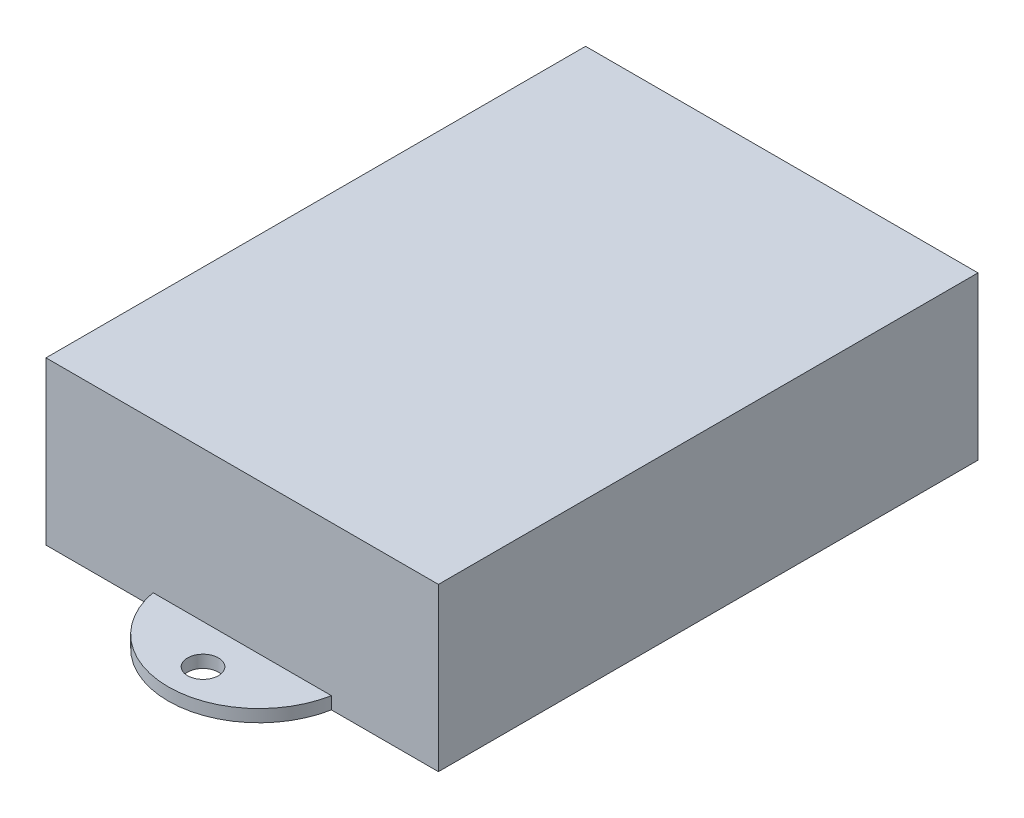
ISO-10303-21;
HEADER;
FILE_DESCRIPTION(('STEP AP214'),'2;1');
FILE_NAME('part.step','',(''),(''),'','','');
FILE_SCHEMA(('AUTOMOTIVE_DESIGN { 1 0 10303 214 1 1 1 1 }'));
ENDSEC;
DATA;
#1=APPLICATION_CONTEXT('core data for automotive mechanical design processes');
#2=APPLICATION_PROTOCOL_DEFINITION('international standard','automotive_design',2000,#1);
#3=PRODUCT_CONTEXT('',#1,'mechanical');
#4=PRODUCT('Part','Part','',(#3));
#5=PRODUCT_RELATED_PRODUCT_CATEGORY('part','',(#4));
#6=PRODUCT_DEFINITION_FORMATION('','',#4);
#7=PRODUCT_DEFINITION_CONTEXT('part definition',#1,'design');
#8=PRODUCT_DEFINITION('design','',#6,#7);
#9=PRODUCT_DEFINITION_SHAPE('','',#8);
#10=(LENGTH_UNIT() NAMED_UNIT(*) SI_UNIT(.MILLI.,.METRE.));
#11=(NAMED_UNIT(*) PLANE_ANGLE_UNIT() SI_UNIT($,.RADIAN.));
#12=(NAMED_UNIT(*) SI_UNIT($,.STERADIAN.) SOLID_ANGLE_UNIT());
#13=UNCERTAINTY_MEASURE_WITH_UNIT(LENGTH_MEASURE(1.E-05),#10,'distance_accuracy_value','');
#14=(GEOMETRIC_REPRESENTATION_CONTEXT(3) GLOBAL_UNCERTAINTY_ASSIGNED_CONTEXT((#13)) GLOBAL_UNIT_ASSIGNED_CONTEXT((#10,
#11,#12)) REPRESENTATION_CONTEXT('',''));
#15=CARTESIAN_POINT('',(0.,0.,0.));
#16=DIRECTION('',(0.,0.,1.));
#17=DIRECTION('',(1.,0.,0.));
#18=AXIS2_PLACEMENT_3D('',#15,#16,#17);
#19=CARTESIAN_POINT('',(0.,21.,0.));
#20=DIRECTION('',(1.,0.,0.));
#21=DIRECTION('',(0.,0.,-1.));
#22=AXIS2_PLACEMENT_3D('',#19,#20,#21);
#23=PLANE('',#22);
#24=DIRECTION('',(0.,0.,1.));
#25=VECTOR('',#24,1.);
#26=CARTESIAN_POINT('',(0.,0.,0.));
#27=LINE('',#26,#25);
#28=CARTESIAN_POINT('',(0.,0.,-69.85));
#29=VERTEX_POINT('',#28);
#30=CARTESIAN_POINT('',(0.,0.,0.));
#31=VERTEX_POINT('',#30);
#32=EDGE_CURVE('E104',#29,#31,#27,.T.);
#33=ORIENTED_EDGE('',*,*,#32,.T.);
#34=DIRECTION('',(0.,-1.,0.));
#35=VECTOR('',#34,1.);
#36=CARTESIAN_POINT('',(0.,21.,0.));
#37=LINE('',#36,#35);
#38=CARTESIAN_POINT('',(0.,21.,0.));
#39=VERTEX_POINT('',#38);
#40=EDGE_CURVE('E41',#39,#31,#37,.T.);
#41=ORIENTED_EDGE('',*,*,#40,.F.);
#42=DIRECTION('',(0.,0.,1.));
#43=VECTOR('',#42,1.);
#44=CARTESIAN_POINT('',(0.,21.,0.));
#45=LINE('',#44,#43);
#46=CARTESIAN_POINT('',(0.,21.,-69.85));
#47=VERTEX_POINT('',#46);
#48=EDGE_CURVE('E137',#47,#39,#45,.T.);
#49=ORIENTED_EDGE('',*,*,#48,.F.);
#50=DIRECTION('',(0.,-1.,0.));
#51=VECTOR('',#50,1.);
#52=CARTESIAN_POINT('',(0.,21.,-69.85));
#53=LINE('',#52,#51);
#54=EDGE_CURVE('E146',#47,#29,#53,.T.);
#55=ORIENTED_EDGE('',*,*,#54,.T.);
#56=EDGE_LOOP('',(#33,#41,#49,#55));
#57=FACE_BOUND('',#56,.T.);
#58=ADVANCED_FACE('F34',(#57),#23,.F.);
#59=CARTESIAN_POINT('',(0.,21.,0.));
#60=DIRECTION('',(0.,0.,-1.));
#61=DIRECTION('',(-1.,0.,0.));
#62=AXIS2_PLACEMENT_3D('',#59,#60,#61);
#63=PLANE('',#62);
#64=DIRECTION('',(-1.,0.,0.));
#65=VECTOR('',#64,1.);
#66=CARTESIAN_POINT('',(0.,1.6,0.));
#67=LINE('',#66,#65);
#68=CARTESIAN_POINT('',(36.95,1.6,0.));
#69=VERTEX_POINT('',#68);
#70=CARTESIAN_POINT('',(13.85,1.6,0.));
#71=VERTEX_POINT('',#70);
#72=EDGE_CURVE('E52',#69,#71,#67,.T.);
#73=ORIENTED_EDGE('',*,*,#72,.F.);
#74=DIRECTION('',(0.,-1.,0.));
#75=VECTOR('',#74,1.);
#76=CARTESIAN_POINT('',(36.95,1.6,0.));
#77=LINE('',#76,#75);
#78=CARTESIAN_POINT('',(36.95,0.,0.));
#79=VERTEX_POINT('',#78);
#80=EDGE_CURVE('E134',#69,#79,#77,.T.);
#81=ORIENTED_EDGE('',*,*,#80,.T.);
#82=DIRECTION('',(1.,0.,0.));
#83=VECTOR('',#82,1.);
#84=CARTESIAN_POINT('',(0.,0.,0.));
#85=LINE('',#84,#83);
#86=CARTESIAN_POINT('',(50.8,0.,0.));
#87=VERTEX_POINT('',#86);
#88=EDGE_CURVE('E148',#79,#87,#85,.T.);
#89=ORIENTED_EDGE('',*,*,#88,.T.);
#90=DIRECTION('',(0.,-1.,0.));
#91=VECTOR('',#90,1.);
#92=CARTESIAN_POINT('',(50.8,21.,0.));
#93=LINE('',#92,#91);
#94=CARTESIAN_POINT('',(50.8,21.,0.));
#95=VERTEX_POINT('',#94);
#96=EDGE_CURVE('E156',#95,#87,#93,.T.);
#97=ORIENTED_EDGE('',*,*,#96,.F.);
#98=DIRECTION('',(1.,0.,0.));
#99=VECTOR('',#98,1.);
#100=CARTESIAN_POINT('',(0.,21.,0.));
#101=LINE('',#100,#99);
#102=EDGE_CURVE('E140',#39,#95,#101,.T.);
#103=ORIENTED_EDGE('',*,*,#102,.F.);
#104=ORIENTED_EDGE('',*,*,#40,.T.);
#105=CARTESIAN_POINT('',(13.85,0.,0.));
#106=VERTEX_POINT('',#105);
#107=EDGE_CURVE('E149',#31,#106,#85,.T.);
#108=ORIENTED_EDGE('',*,*,#107,.T.);
#109=DIRECTION('',(0.,-1.,0.));
#110=VECTOR('',#109,1.);
#111=CARTESIAN_POINT('',(13.85,1.6,0.));
#112=LINE('',#111,#110);
#113=EDGE_CURVE('E48',#106,#71,#112,.F.);
#114=ORIENTED_EDGE('',*,*,#113,.T.);
#115=EDGE_LOOP('',(#73,#81,#89,#97,#103,#104,#108,#114));
#116=FACE_BOUND('',#115,.T.);
#117=ADVANCED_FACE('F160',(#116),#63,.F.);
#118=CARTESIAN_POINT('',(50.8,21.,0.));
#119=DIRECTION('',(-1.,0.,0.));
#120=DIRECTION('',(0.,0.,1.));
#121=AXIS2_PLACEMENT_3D('',#118,#119,#120);
#122=PLANE('',#121);
#123=DIRECTION('',(0.,0.,-1.));
#124=VECTOR('',#123,1.);
#125=CARTESIAN_POINT('',(50.8,0.,0.));
#126=LINE('',#125,#124);
#127=CARTESIAN_POINT('',(50.8,0.,-69.85));
#128=VERTEX_POINT('',#127);
#129=EDGE_CURVE('E109',#87,#128,#126,.T.);
#130=ORIENTED_EDGE('',*,*,#129,.T.);
#131=DIRECTION('',(0.,-1.,0.));
#132=VECTOR('',#131,1.);
#133=CARTESIAN_POINT('',(50.8,21.,-69.85));
#134=LINE('',#133,#132);
#135=CARTESIAN_POINT('',(50.8,21.,-69.85));
#136=VERTEX_POINT('',#135);
#137=EDGE_CURVE('E153',#136,#128,#134,.T.);
#138=ORIENTED_EDGE('',*,*,#137,.F.);
#139=DIRECTION('',(0.,0.,-1.));
#140=VECTOR('',#139,1.);
#141=CARTESIAN_POINT('',(50.8,21.,0.));
#142=LINE('',#141,#140);
#143=EDGE_CURVE('E142',#95,#136,#142,.T.);
#144=ORIENTED_EDGE('',*,*,#143,.F.);
#145=ORIENTED_EDGE('',*,*,#96,.T.);
#146=EDGE_LOOP('',(#130,#138,#144,#145));
#147=FACE_BOUND('',#146,.T.);
#148=ADVANCED_FACE('F170',(#147),#122,.F.);
#149=CARTESIAN_POINT('',(0.,21.,-69.85));
#150=DIRECTION('',(0.,0.,1.));
#151=DIRECTION('',(1.,0.,0.));
#152=AXIS2_PLACEMENT_3D('',#149,#150,#151);
#153=PLANE('',#152);
#154=DIRECTION('',(1.,0.,0.));
#155=VECTOR('',#154,1.);
#156=CARTESIAN_POINT('',(0.,1.6,-69.85));
#157=LINE('',#156,#155);
#158=CARTESIAN_POINT('',(13.85,1.6,-69.85));
#159=VERTEX_POINT('',#158);
#160=CARTESIAN_POINT('',(36.95,1.6,-69.85));
#161=VERTEX_POINT('',#160);
#162=EDGE_CURVE('E11',#159,#161,#157,.T.);
#163=ORIENTED_EDGE('',*,*,#162,.F.);
#164=DIRECTION('',(0.,-1.,0.));
#165=VECTOR('',#164,1.);
#166=CARTESIAN_POINT('',(13.85,1.6,-69.85));
#167=LINE('',#166,#165);
#168=CARTESIAN_POINT('',(13.85,0.,-69.85));
#169=VERTEX_POINT('',#168);
#170=EDGE_CURVE('E112',#159,#169,#167,.T.);
#171=ORIENTED_EDGE('',*,*,#170,.T.);
#172=DIRECTION('',(-1.,0.,0.));
#173=VECTOR('',#172,1.);
#174=CARTESIAN_POINT('',(0.,0.,-69.85));
#175=LINE('',#174,#173);
#176=EDGE_CURVE('E97',#169,#29,#175,.T.);
#177=ORIENTED_EDGE('',*,*,#176,.T.);
#178=ORIENTED_EDGE('',*,*,#54,.F.);
#179=DIRECTION('',(-1.,0.,0.));
#180=VECTOR('',#179,1.);
#181=CARTESIAN_POINT('',(0.,21.,-69.85));
#182=LINE('',#181,#180);
#183=EDGE_CURVE('E144',#136,#47,#182,.T.);
#184=ORIENTED_EDGE('',*,*,#183,.F.);
#185=ORIENTED_EDGE('',*,*,#137,.T.);
#186=CARTESIAN_POINT('',(36.95,0.,-69.85));
#187=VERTEX_POINT('',#186);
#188=EDGE_CURVE('E108',#128,#187,#175,.T.);
#189=ORIENTED_EDGE('',*,*,#188,.T.);
#190=DIRECTION('',(0.,-1.,0.));
#191=VECTOR('',#190,1.);
#192=CARTESIAN_POINT('',(36.95,1.6,-69.85));
#193=LINE('',#192,#191);
#194=EDGE_CURVE('E117',#187,#161,#193,.F.);
#195=ORIENTED_EDGE('',*,*,#194,.T.);
#196=EDGE_LOOP('',(#163,#171,#177,#178,#184,#185,#189,#195));
#197=FACE_BOUND('',#196,.T.);
#198=ADVANCED_FACE('F113',(#197),#153,.F.);
#199=CARTESIAN_POINT('',(0.,21.,0.));
#200=DIRECTION('',(0.,-1.,0.));
#201=DIRECTION('',(0.,0.,-1.));
#202=AXIS2_PLACEMENT_3D('',#199,#200,#201);
#203=PLANE('',#202);
#204=ORIENTED_EDGE('',*,*,#48,.T.);
#205=ORIENTED_EDGE('',*,*,#102,.T.);
#206=ORIENTED_EDGE('',*,*,#143,.T.);
#207=ORIENTED_EDGE('',*,*,#183,.T.);
#208=EDGE_LOOP('',(#204,#205,#206,#207));
#209=FACE_BOUND('',#208,.T.);
#210=ADVANCED_FACE('F167',(#209),#203,.F.);
#211=CARTESIAN_POINT('',(0.,0.,0.));
#212=DIRECTION('',(0.,-1.,0.));
#213=DIRECTION('',(0.,0.,-1.));
#214=AXIS2_PLACEMENT_3D('',#211,#212,#213);
#215=PLANE('',#214);
#216=CARTESIAN_POINT('',(25.4,0.,5.075));
#217=DIRECTION('',(0.,1.,0.));
#218=DIRECTION('',(0.,0.,1.));
#219=AXIS2_PLACEMENT_3D('',#216,#217,#218);
#220=CIRCLE('',#219,2.);
#221=CARTESIAN_POINT('',(25.4,0.,7.075));
#222=VERTEX_POINT('',#221);
#223=EDGE_CURVE('E178',#222,#222,#220,.T.);
#224=ORIENTED_EDGE('',*,*,#223,.T.);
#225=EDGE_LOOP('',(#224));
#226=FACE_BOUND('',#225,.T.);
#227=CARTESIAN_POINT('',(25.4,0.,-74.925));
#228=DIRECTION('',(0.,1.,0.));
#229=DIRECTION('',(0.,0.,1.));
#230=AXIS2_PLACEMENT_3D('',#227,#228,#229);
#231=CIRCLE('',#230,2.);
#232=CARTESIAN_POINT('',(25.4,0.,-72.925));
#233=VERTEX_POINT('',#232);
#234=EDGE_CURVE('E128',#233,#233,#231,.T.);
#235=ORIENTED_EDGE('',*,*,#234,.T.);
#236=EDGE_LOOP('',(#235));
#237=FACE_BOUND('',#236,.T.);
#238=ORIENTED_EDGE('',*,*,#88,.F.);
#239=CARTESIAN_POINT('',(25.4,0.,-2.17868798955614));
#240=DIRECTION('',(0.,-1.,0.));
#241=DIRECTION('',(0.,0.,-1.));
#242=AXIS2_PLACEMENT_3D('',#239,#240,#241);
#243=CIRCLE('',#242,11.7536879895561);
#244=EDGE_CURVE('E122',#79,#106,#243,.T.);
#245=ORIENTED_EDGE('',*,*,#244,.T.);
#246=ORIENTED_EDGE('',*,*,#107,.F.);
#247=ORIENTED_EDGE('',*,*,#32,.F.);
#248=ORIENTED_EDGE('',*,*,#176,.F.);
#249=CARTESIAN_POINT('',(25.4,0.,-67.6713120104439));
#250=DIRECTION('',(0.,-1.,0.));
#251=DIRECTION('',(0.,0.,-1.));
#252=AXIS2_PLACEMENT_3D('',#249,#250,#251);
#253=CIRCLE('',#252,11.7536879895561);
#254=EDGE_CURVE('E102',#169,#187,#253,.T.);
#255=ORIENTED_EDGE('',*,*,#254,.T.);
#256=ORIENTED_EDGE('',*,*,#188,.F.);
#257=ORIENTED_EDGE('',*,*,#129,.F.);
#258=EDGE_LOOP('',(#238,#245,#246,#247,#248,#255,#256,#257));
#259=FACE_BOUND('',#258,.T.);
#260=ADVANCED_FACE('F99',(#226,#237,#259),#215,.T.);
#261=CARTESIAN_POINT('',(25.4,1.6,-2.17868798955614));
#262=DIRECTION('',(0.,-1.,0.));
#263=DIRECTION('',(0.,0.,-1.));
#264=AXIS2_PLACEMENT_3D('',#261,#262,#263);
#265=PLANE('',#264);
#266=CARTESIAN_POINT('',(25.4,1.6,-74.925));
#267=DIRECTION('',(0.,1.,0.));
#268=DIRECTION('',(0.,0.,1.));
#269=AXIS2_PLACEMENT_3D('',#266,#267,#268);
#270=CIRCLE('',#269,2.);
#271=CARTESIAN_POINT('',(25.4,1.6,-72.925));
#272=VERTEX_POINT('',#271);
#273=EDGE_CURVE('E175',#272,#272,#270,.T.);
#274=ORIENTED_EDGE('',*,*,#273,.F.);
#275=EDGE_LOOP('',(#274));
#276=FACE_BOUND('',#275,.T.);
#277=CARTESIAN_POINT('',(25.4,1.6,-67.6713120104439));
#278=DIRECTION('',(0.,-1.,0.));
#279=DIRECTION('',(0.,0.,-1.));
#280=AXIS2_PLACEMENT_3D('',#277,#278,#279);
#281=CIRCLE('',#280,11.7536879895561);
#282=EDGE_CURVE('E125',#159,#161,#281,.T.);
#283=ORIENTED_EDGE('',*,*,#282,.F.);
#284=ORIENTED_EDGE('',*,*,#162,.T.);
#285=EDGE_LOOP('',(#283,#284));
#286=FACE_BOUND('',#285,.T.);
#287=ADVANCED_FACE('F173',(#276,#286),#265,.F.);
#288=CARTESIAN_POINT('',(25.4,1.6,-67.6713120104439));
#289=DIRECTION('',(0.,-1.,0.));
#290=DIRECTION('',(0.,0.,-1.));
#291=AXIS2_PLACEMENT_3D('',#288,#289,#290);
#292=CYLINDRICAL_SURFACE('',#291,11.7536879895561);
#293=ORIENTED_EDGE('',*,*,#170,.F.);
#294=ORIENTED_EDGE('',*,*,#282,.T.);
#295=ORIENTED_EDGE('',*,*,#194,.F.);
#296=ORIENTED_EDGE('',*,*,#254,.F.);
#297=EDGE_LOOP('',(#293,#294,#295,#296));
#298=FACE_BOUND('',#297,.T.);
#299=ADVANCED_FACE('F120',(#298),#292,.T.);
#300=CARTESIAN_POINT('',(25.4,1.6,5.075));
#301=DIRECTION('',(0.,1.,0.));
#302=DIRECTION('',(0.,0.,1.));
#303=AXIS2_PLACEMENT_3D('',#300,#301,#302);
#304=CIRCLE('',#303,2.);
#305=CARTESIAN_POINT('',(25.4,1.6,7.075));
#306=VERTEX_POINT('',#305);
#307=EDGE_CURVE('E181',#306,#306,#304,.T.);
#308=ORIENTED_EDGE('',*,*,#307,.F.);
#309=EDGE_LOOP('',(#308));
#310=FACE_BOUND('',#309,.T.);
#311=CARTESIAN_POINT('',(25.4,1.6,-2.17868798955614));
#312=DIRECTION('',(0.,-1.,0.));
#313=DIRECTION('',(0.,0.,-1.));
#314=AXIS2_PLACEMENT_3D('',#311,#312,#313);
#315=CIRCLE('',#314,11.7536879895561);
#316=EDGE_CURVE('E121',#69,#71,#315,.T.);
#317=ORIENTED_EDGE('',*,*,#316,.F.);
#318=ORIENTED_EDGE('',*,*,#72,.T.);
#319=EDGE_LOOP('',(#317,#318));
#320=FACE_BOUND('',#319,.T.);
#321=ADVANCED_FACE('F196',(#310,#320),#265,.F.);
#322=CARTESIAN_POINT('',(25.4,1.6,-2.17868798955614));
#323=DIRECTION('',(0.,-1.,0.));
#324=DIRECTION('',(0.,0.,-1.));
#325=AXIS2_PLACEMENT_3D('',#322,#323,#324);
#326=CYLINDRICAL_SURFACE('',#325,11.7536879895561);
#327=ORIENTED_EDGE('',*,*,#80,.F.);
#328=ORIENTED_EDGE('',*,*,#316,.T.);
#329=ORIENTED_EDGE('',*,*,#113,.F.);
#330=ORIENTED_EDGE('',*,*,#244,.F.);
#331=EDGE_LOOP('',(#327,#328,#329,#330));
#332=FACE_BOUND('',#331,.T.);
#333=ADVANCED_FACE('F199',(#332),#326,.T.);
#334=CARTESIAN_POINT('',(25.4,0.,-74.925));
#335=DIRECTION('',(0.,1.,0.));
#336=DIRECTION('',(0.,0.,1.));
#337=AXIS2_PLACEMENT_3D('',#334,#335,#336);
#338=CYLINDRICAL_SURFACE('',#337,2.);
#339=ORIENTED_EDGE('',*,*,#234,.F.);
#340=EDGE_LOOP('',(#339));
#341=FACE_BOUND('',#340,.T.);
#342=ORIENTED_EDGE('',*,*,#273,.T.);
#343=EDGE_LOOP('',(#342));
#344=FACE_BOUND('',#343,.T.);
#345=ADVANCED_FACE('F192',(#341,#344),#338,.F.);
#346=CARTESIAN_POINT('',(25.4,0.,5.075));
#347=DIRECTION('',(0.,1.,0.));
#348=DIRECTION('',(0.,0.,1.));
#349=AXIS2_PLACEMENT_3D('',#346,#347,#348);
#350=CYLINDRICAL_SURFACE('',#349,2.);
#351=ORIENTED_EDGE('',*,*,#223,.F.);
#352=EDGE_LOOP('',(#351));
#353=FACE_BOUND('',#352,.T.);
#354=ORIENTED_EDGE('',*,*,#307,.T.);
#355=EDGE_LOOP('',(#354));
#356=FACE_BOUND('',#355,.T.);
#357=ADVANCED_FACE('F189',(#353,#356),#350,.F.);
#358=CLOSED_SHELL('',(#58,#117,#148,#198,#210,#260,#287,#299,#321,#333,#345,#357));
#359=MANIFOLD_SOLID_BREP('B2',#358);
#360=ADVANCED_BREP_SHAPE_REPRESENTATION('',(#18,#359),#14);
#361=SHAPE_DEFINITION_REPRESENTATION(#9,#360);
ENDSEC;
END-ISO-10303-21;
